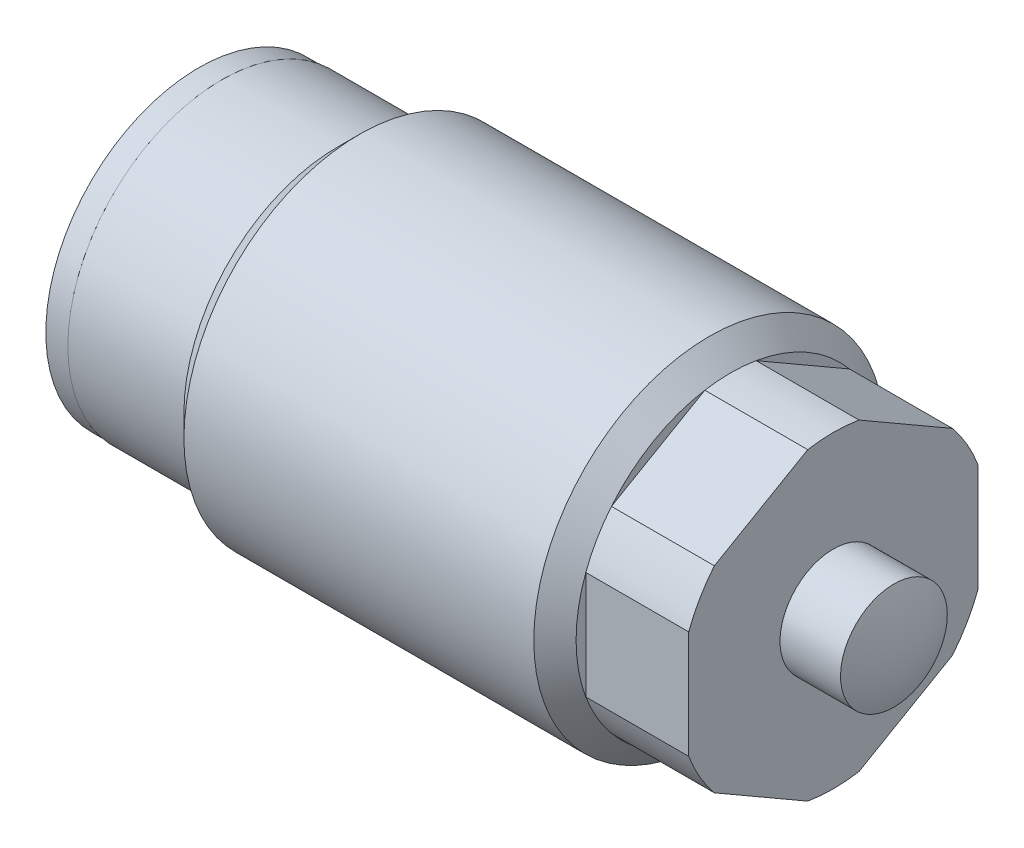
ISO-10303-21;
HEADER;
FILE_DESCRIPTION(('STEP AP214'),'2;1');
FILE_NAME('part.step','',(''),(''),'','','');
FILE_SCHEMA(('AUTOMOTIVE_DESIGN { 1 0 10303 214 1 1 1 1 }'));
ENDSEC;
DATA;
#1=APPLICATION_CONTEXT('core data for automotive mechanical design processes');
#2=APPLICATION_PROTOCOL_DEFINITION('international standard','automotive_design',2000,#1);
#3=PRODUCT_CONTEXT('',#1,'mechanical');
#4=PRODUCT('Part','Part','',(#3));
#5=PRODUCT_RELATED_PRODUCT_CATEGORY('part','',(#4));
#6=PRODUCT_DEFINITION_FORMATION('','',#4);
#7=PRODUCT_DEFINITION_CONTEXT('part definition',#1,'design');
#8=PRODUCT_DEFINITION('design','',#6,#7);
#9=PRODUCT_DEFINITION_SHAPE('','',#8);
#10=(LENGTH_UNIT() NAMED_UNIT(*) SI_UNIT(.MILLI.,.METRE.));
#11=(NAMED_UNIT(*) PLANE_ANGLE_UNIT() SI_UNIT($,.RADIAN.));
#12=(NAMED_UNIT(*) SI_UNIT($,.STERADIAN.) SOLID_ANGLE_UNIT());
#13=UNCERTAINTY_MEASURE_WITH_UNIT(LENGTH_MEASURE(1.E-05),#10,'distance_accuracy_value','');
#14=(GEOMETRIC_REPRESENTATION_CONTEXT(3) GLOBAL_UNCERTAINTY_ASSIGNED_CONTEXT((#13)) GLOBAL_UNIT_ASSIGNED_CONTEXT((#10,
#11,#12)) REPRESENTATION_CONTEXT('',''));
#15=CARTESIAN_POINT('',(0.,0.,0.));
#16=DIRECTION('',(0.,0.,1.));
#17=DIRECTION('',(1.,0.,0.));
#18=AXIS2_PLACEMENT_3D('',#15,#16,#17);
#19=CARTESIAN_POINT('',(22.606,7.7978,0.));
#20=DIRECTION('',(1.,0.,0.));
#21=DIRECTION('',(0.,0.,-1.));
#22=AXIS2_PLACEMENT_3D('',#19,#20,#21);
#23=PLANE('',#22);
#24=DIRECTION('',(0.,-0.5,-0.866025403784439));
#25=VECTOR('',#24,1.);
#26=CARTESIAN_POINT('',(22.606,-3.71016829986637,6.4262));
#27=LINE('',#26,#25);
#28=CARTESIAN_POINT('',(22.606,-4.36774278804313,5.28724757671676));
#29=VERTEX_POINT('',#28);
#30=CARTESIAN_POINT('',(22.606,-6.76276211155599,1.13895242328324));
#31=VERTEX_POINT('',#30);
#32=EDGE_CURVE('E196',#29,#31,#27,.T.);
#33=ORIENTED_EDGE('',*,*,#32,.F.);
#34=CARTESIAN_POINT('',(22.606,0.,0.));
#35=DIRECTION('',(1.,0.,0.));
#36=DIRECTION('',(0.,0.,-1.));
#37=AXIS2_PLACEMENT_3D('',#34,#35,#36);
#38=CIRCLE('',#37,6.85799999999999);
#39=EDGE_CURVE('E12',#29,#31,#38,.T.);
#40=ORIENTED_EDGE('',*,*,#39,.T.);
#41=EDGE_LOOP('',(#33,#40));
#42=FACE_BOUND('',#41,.T.);
#43=ADVANCED_FACE('F41',(#42),#23,.T.);
#44=DIRECTION('',(0.,0.5,-0.866025403784439));
#45=VECTOR('',#44,1.);
#46=CARTESIAN_POINT('',(22.606,-7.42033659973275,0.));
#47=LINE('',#46,#45);
#48=CARTESIAN_POINT('',(22.606,-6.76276211155599,-1.13895242328325));
#49=VERTEX_POINT('',#48);
#50=CARTESIAN_POINT('',(22.606,-4.36774278804314,-5.28724757671675));
#51=VERTEX_POINT('',#50);
#52=EDGE_CURVE('E194',#49,#51,#47,.T.);
#53=ORIENTED_EDGE('',*,*,#52,.F.);
#54=CARTESIAN_POINT('',(22.606,0.,0.));
#55=DIRECTION('',(1.,0.,0.));
#56=DIRECTION('',(0.,0.,-1.));
#57=AXIS2_PLACEMENT_3D('',#54,#55,#56);
#58=CIRCLE('',#57,6.85799999999999);
#59=EDGE_CURVE('E49',#49,#51,#58,.T.);
#60=ORIENTED_EDGE('',*,*,#59,.T.);
#61=EDGE_LOOP('',(#53,#60));
#62=FACE_BOUND('',#61,.T.);
#63=ADVANCED_FACE('F271',(#62),#23,.T.);
#64=DIRECTION('',(0.,1.,0.));
#65=VECTOR('',#64,1.);
#66=CARTESIAN_POINT('',(22.606,-3.71016829986638,-6.4262));
#67=LINE('',#66,#65);
#68=CARTESIAN_POINT('',(22.606,-2.39501932351286,-6.4262));
#69=VERTEX_POINT('',#68);
#70=CARTESIAN_POINT('',(22.606,2.39501932351286,-6.4262));
#71=VERTEX_POINT('',#70);
#72=EDGE_CURVE('E150',#69,#71,#67,.T.);
#73=ORIENTED_EDGE('',*,*,#72,.F.);
#74=CARTESIAN_POINT('',(22.606,0.,0.));
#75=DIRECTION('',(1.,0.,0.));
#76=DIRECTION('',(0.,0.,-1.));
#77=AXIS2_PLACEMENT_3D('',#74,#75,#76);
#78=CIRCLE('',#77,6.85799999999999);
#79=EDGE_CURVE('E159',#69,#71,#78,.T.);
#80=ORIENTED_EDGE('',*,*,#79,.T.);
#81=EDGE_LOOP('',(#73,#80));
#82=FACE_BOUND('',#81,.T.);
#83=ADVANCED_FACE('F158',(#82),#23,.T.);
#84=DIRECTION('',(0.,0.5,0.866025403784438));
#85=VECTOR('',#84,1.);
#86=CARTESIAN_POINT('',(22.606,3.71016829986637,-6.4262));
#87=LINE('',#86,#85);
#88=CARTESIAN_POINT('',(22.606,4.36774278804313,-5.28724757671676));
#89=VERTEX_POINT('',#88);
#90=CARTESIAN_POINT('',(22.606,6.76276211155599,-1.13895242328325));
#91=VERTEX_POINT('',#90);
#92=EDGE_CURVE('E161',#89,#91,#87,.T.);
#93=ORIENTED_EDGE('',*,*,#92,.F.);
#94=CARTESIAN_POINT('',(22.606,0.,0.));
#95=DIRECTION('',(1.,0.,0.));
#96=DIRECTION('',(0.,0.,-1.));
#97=AXIS2_PLACEMENT_3D('',#94,#95,#96);
#98=CIRCLE('',#97,6.85799999999999);
#99=EDGE_CURVE('E166',#89,#91,#98,.T.);
#100=ORIENTED_EDGE('',*,*,#99,.T.);
#101=EDGE_LOOP('',(#93,#100));
#102=FACE_BOUND('',#101,.T.);
#103=ADVANCED_FACE('F278',(#102),#23,.T.);
#104=DIRECTION('',(0.,-0.5,0.866025403784439));
#105=VECTOR('',#104,1.);
#106=CARTESIAN_POINT('',(22.606,7.42033659973275,0.));
#107=LINE('',#106,#105);
#108=CARTESIAN_POINT('',(22.606,6.76276211155599,1.13895242328324));
#109=VERTEX_POINT('',#108);
#110=CARTESIAN_POINT('',(22.606,4.36774278804313,5.28724757671676));
#111=VERTEX_POINT('',#110);
#112=EDGE_CURVE('E202',#109,#111,#107,.T.);
#113=ORIENTED_EDGE('',*,*,#112,.F.);
#114=CARTESIAN_POINT('',(22.606,0.,0.));
#115=DIRECTION('',(1.,0.,0.));
#116=DIRECTION('',(0.,0.,-1.));
#117=AXIS2_PLACEMENT_3D('',#114,#115,#116);
#118=CIRCLE('',#117,6.85799999999999);
#119=EDGE_CURVE('E168',#109,#111,#118,.T.);
#120=ORIENTED_EDGE('',*,*,#119,.T.);
#121=EDGE_LOOP('',(#113,#120));
#122=FACE_BOUND('',#121,.T.);
#123=ADVANCED_FACE('F286',(#122),#23,.T.);
#124=CARTESIAN_POINT('',(27.178,-3.71016829986638,-6.4262));
#125=DIRECTION('',(0.,0.,1.));
#126=DIRECTION('',(1.,0.,0.));
#127=AXIS2_PLACEMENT_3D('',#124,#125,#126);
#128=PLANE('',#127);
#129=DIRECTION('',(1.,0.,0.));
#130=VECTOR('',#129,1.);
#131=CARTESIAN_POINT('',(0.550490966654157,-2.39501932351286,-6.4262));
#132=LINE('',#131,#130);
#133=CARTESIAN_POINT('',(27.178,-2.39501932351286,-6.4262));
#134=VERTEX_POINT('',#133);
#135=EDGE_CURVE('E133',#69,#134,#132,.T.);
#136=ORIENTED_EDGE('',*,*,#135,.F.);
#137=ORIENTED_EDGE('',*,*,#72,.T.);
#138=DIRECTION('',(1.,0.,0.));
#139=VECTOR('',#138,1.);
#140=CARTESIAN_POINT('',(0.550490966654157,2.39501932351286,-6.4262));
#141=LINE('',#140,#139);
#142=CARTESIAN_POINT('',(27.178,2.39501932351286,-6.4262));
#143=VERTEX_POINT('',#142);
#144=EDGE_CURVE('E155',#143,#71,#141,.F.);
#145=ORIENTED_EDGE('',*,*,#144,.F.);
#146=DIRECTION('',(0.,1.,0.));
#147=VECTOR('',#146,1.);
#148=CARTESIAN_POINT('',(27.178,-3.71016829986638,-6.4262));
#149=LINE('',#148,#147);
#150=EDGE_CURVE('E153',#134,#143,#149,.T.);
#151=ORIENTED_EDGE('',*,*,#150,.F.);
#152=EDGE_LOOP('',(#136,#137,#145,#151));
#153=FACE_BOUND('',#152,.T.);
#154=ADVANCED_FACE('F148',(#153),#128,.F.);
#155=CARTESIAN_POINT('',(27.178,3.71016829986637,-6.4262));
#156=DIRECTION('',(0.,-0.866025403784438,0.5));
#157=DIRECTION('',(0.,-0.5,-0.866025403784439));
#158=AXIS2_PLACEMENT_3D('',#155,#156,#157);
#159=PLANE('',#158);
#160=DIRECTION('',(1.,0.,0.));
#161=VECTOR('',#160,1.);
#162=CARTESIAN_POINT('',(0.550490966654157,4.36774278804313,-5.28724757671676));
#163=LINE('',#162,#161);
#164=CARTESIAN_POINT('',(27.178,4.36774278804313,-5.28724757671676));
#165=VERTEX_POINT('',#164);
#166=EDGE_CURVE('E230',#89,#165,#163,.T.);
#167=ORIENTED_EDGE('',*,*,#166,.F.);
#168=ORIENTED_EDGE('',*,*,#92,.T.);
#169=DIRECTION('',(1.,0.,0.));
#170=VECTOR('',#169,1.);
#171=CARTESIAN_POINT('',(0.550490966654157,6.76276211155599,-1.13895242328324));
#172=LINE('',#171,#170);
#173=CARTESIAN_POINT('',(27.178,6.76276211155599,-1.13895242328324));
#174=VERTEX_POINT('',#173);
#175=EDGE_CURVE('E232',#174,#91,#172,.F.);
#176=ORIENTED_EDGE('',*,*,#175,.F.);
#177=DIRECTION('',(0.,0.5,0.866025403784438));
#178=VECTOR('',#177,1.);
#179=CARTESIAN_POINT('',(27.178,3.71016829986637,-6.4262));
#180=LINE('',#179,#178);
#181=EDGE_CURVE('E218',#165,#174,#180,.T.);
#182=ORIENTED_EDGE('',*,*,#181,.F.);
#183=EDGE_LOOP('',(#167,#168,#176,#182));
#184=FACE_BOUND('',#183,.T.);
#185=ADVANCED_FACE('F316',(#184),#159,.F.);
#186=CARTESIAN_POINT('',(27.178,7.42033659973275,0.));
#187=DIRECTION('',(0.,-0.866025403784439,-0.5));
#188=DIRECTION('',(0.,0.5,-0.866025403784439));
#189=AXIS2_PLACEMENT_3D('',#186,#187,#188);
#190=PLANE('',#189);
#191=DIRECTION('',(1.,0.,0.));
#192=VECTOR('',#191,1.);
#193=CARTESIAN_POINT('',(0.550490966654157,6.76276211155599,1.13895242328324));
#194=LINE('',#193,#192);
#195=CARTESIAN_POINT('',(27.178,6.76276211155599,1.13895242328324));
#196=VERTEX_POINT('',#195);
#197=EDGE_CURVE('E235',#109,#196,#194,.T.);
#198=ORIENTED_EDGE('',*,*,#197,.F.);
#199=ORIENTED_EDGE('',*,*,#112,.T.);
#200=DIRECTION('',(1.,0.,0.));
#201=VECTOR('',#200,1.);
#202=CARTESIAN_POINT('',(0.550490966654157,4.36774278804313,5.28724757671675));
#203=LINE('',#202,#201);
#204=CARTESIAN_POINT('',(27.178,4.36774278804313,5.28724757671675));
#205=VERTEX_POINT('',#204);
#206=EDGE_CURVE('E237',#205,#111,#203,.F.);
#207=ORIENTED_EDGE('',*,*,#206,.F.);
#208=DIRECTION('',(0.,-0.5,0.866025403784439));
#209=VECTOR('',#208,1.);
#210=CARTESIAN_POINT('',(27.178,7.42033659973275,0.));
#211=LINE('',#210,#209);
#212=EDGE_CURVE('E215',#196,#205,#211,.T.);
#213=ORIENTED_EDGE('',*,*,#212,.F.);
#214=EDGE_LOOP('',(#198,#199,#207,#213));
#215=FACE_BOUND('',#214,.T.);
#216=ADVANCED_FACE('F319',(#215),#190,.F.);
#217=CARTESIAN_POINT('',(27.178,3.71016829986638,6.4262));
#218=DIRECTION('',(0.,0.,-1.));
#219=DIRECTION('',(0.,1.,0.));
#220=AXIS2_PLACEMENT_3D('',#217,#218,#219);
#221=PLANE('',#220);
#222=DIRECTION('',(1.,0.,0.));
#223=VECTOR('',#222,1.);
#224=CARTESIAN_POINT('',(0.550490966654157,2.39501932351287,6.4262));
#225=LINE('',#224,#223);
#226=CARTESIAN_POINT('',(22.606,2.39501932351287,6.4262));
#227=VERTEX_POINT('',#226);
#228=CARTESIAN_POINT('',(27.178,2.39501932351287,6.4262));
#229=VERTEX_POINT('',#228);
#230=EDGE_CURVE('E240',#227,#229,#225,.T.);
#231=ORIENTED_EDGE('',*,*,#230,.F.);
#232=DIRECTION('',(0.,-1.,0.));
#233=VECTOR('',#232,1.);
#234=CARTESIAN_POINT('',(22.606,3.71016829986638,6.4262));
#235=LINE('',#234,#233);
#236=CARTESIAN_POINT('',(22.606,-2.39501932351287,6.4262));
#237=VERTEX_POINT('',#236);
#238=EDGE_CURVE('E199',#227,#237,#235,.T.);
#239=ORIENTED_EDGE('',*,*,#238,.T.);
#240=DIRECTION('',(1.,0.,0.));
#241=VECTOR('',#240,1.);
#242=CARTESIAN_POINT('',(0.550490966654157,-2.39501932351287,6.4262));
#243=LINE('',#242,#241);
#244=CARTESIAN_POINT('',(27.178,-2.39501932351287,6.4262));
#245=VERTEX_POINT('',#244);
#246=EDGE_CURVE('E242',#245,#237,#243,.F.);
#247=ORIENTED_EDGE('',*,*,#246,.F.);
#248=DIRECTION('',(0.,-1.,0.));
#249=VECTOR('',#248,1.);
#250=CARTESIAN_POINT('',(27.178,3.71016829986638,6.4262));
#251=LINE('',#250,#249);
#252=EDGE_CURVE('E212',#229,#245,#251,.T.);
#253=ORIENTED_EDGE('',*,*,#252,.F.);
#254=EDGE_LOOP('',(#231,#239,#247,#253));
#255=FACE_BOUND('',#254,.T.);
#256=ADVANCED_FACE('F323',(#255),#221,.F.);
#257=CARTESIAN_POINT('',(27.178,-3.71016829986637,6.4262));
#258=DIRECTION('',(0.,0.866025403784439,-0.5));
#259=DIRECTION('',(0.,0.5,0.866025403784439));
#260=AXIS2_PLACEMENT_3D('',#257,#258,#259);
#261=PLANE('',#260);
#262=DIRECTION('',(1.,0.,0.));
#263=VECTOR('',#262,1.);
#264=CARTESIAN_POINT('',(0.550490966654157,-4.36774278804313,5.28724757671676));
#265=LINE('',#264,#263);
#266=CARTESIAN_POINT('',(27.178,-4.36774278804313,5.28724757671676));
#267=VERTEX_POINT('',#266);
#268=EDGE_CURVE('E64',#29,#267,#265,.T.);
#269=ORIENTED_EDGE('',*,*,#268,.F.);
#270=ORIENTED_EDGE('',*,*,#32,.T.);
#271=DIRECTION('',(1.,0.,0.));
#272=VECTOR('',#271,1.);
#273=CARTESIAN_POINT('',(0.550490966654157,-6.76276211155599,1.13895242328324));
#274=LINE('',#273,#272);
#275=CARTESIAN_POINT('',(27.178,-6.76276211155599,1.13895242328324));
#276=VERTEX_POINT('',#275);
#277=EDGE_CURVE('E246',#276,#31,#274,.F.);
#278=ORIENTED_EDGE('',*,*,#277,.F.);
#279=DIRECTION('',(0.,-0.5,-0.866025403784439));
#280=VECTOR('',#279,1.);
#281=CARTESIAN_POINT('',(27.178,-3.71016829986637,6.4262));
#282=LINE('',#281,#280);
#283=EDGE_CURVE('E209',#267,#276,#282,.T.);
#284=ORIENTED_EDGE('',*,*,#283,.F.);
#285=EDGE_LOOP('',(#269,#270,#278,#284));
#286=FACE_BOUND('',#285,.T.);
#287=ADVANCED_FACE('F327',(#286),#261,.F.);
#288=CARTESIAN_POINT('',(27.178,-7.42033659973275,0.));
#289=DIRECTION('',(0.,0.866025403784439,0.5));
#290=DIRECTION('',(0.,-0.5,0.866025403784439));
#291=AXIS2_PLACEMENT_3D('',#288,#289,#290);
#292=PLANE('',#291);
#293=DIRECTION('',(1.,0.,0.));
#294=VECTOR('',#293,1.);
#295=CARTESIAN_POINT('',(0.550490966654157,-6.76276211155599,-1.13895242328324));
#296=LINE('',#295,#294);
#297=CARTESIAN_POINT('',(27.178,-6.76276211155599,-1.13895242328324));
#298=VERTEX_POINT('',#297);
#299=EDGE_CURVE('E56',#49,#298,#296,.T.);
#300=ORIENTED_EDGE('',*,*,#299,.F.);
#301=ORIENTED_EDGE('',*,*,#52,.T.);
#302=DIRECTION('',(1.,0.,0.));
#303=VECTOR('',#302,1.);
#304=CARTESIAN_POINT('',(0.550490966654157,-4.36774278804313,-5.28724757671675));
#305=LINE('',#304,#303);
#306=CARTESIAN_POINT('',(27.178,-4.36774278804313,-5.28724757671676));
#307=VERTEX_POINT('',#306);
#308=EDGE_CURVE('E136',#307,#51,#305,.F.);
#309=ORIENTED_EDGE('',*,*,#308,.F.);
#310=DIRECTION('',(0.,0.5,-0.866025403784439));
#311=VECTOR('',#310,1.);
#312=CARTESIAN_POINT('',(27.178,-7.42033659973275,0.));
#313=LINE('',#312,#311);
#314=EDGE_CURVE('E193',#298,#307,#313,.T.);
#315=ORIENTED_EDGE('',*,*,#314,.F.);
#316=EDGE_LOOP('',(#300,#301,#309,#315));
#317=FACE_BOUND('',#316,.T.);
#318=ADVANCED_FACE('F269',(#317),#292,.F.);
#319=CARTESIAN_POINT('',(27.178,11.1305048995991,-6.4262));
#320=DIRECTION('',(1.,0.,0.));
#321=DIRECTION('',(0.,0.,-1.));
#322=AXIS2_PLACEMENT_3D('',#319,#320,#321);
#323=PLANE('',#322);
#324=CARTESIAN_POINT('',(27.178,0.,0.));
#325=DIRECTION('',(1.,0.,0.));
#326=DIRECTION('',(0.,0.,-1.));
#327=AXIS2_PLACEMENT_3D('',#324,#325,#326);
#328=CIRCLE('',#327,2.37109);
#329=CARTESIAN_POINT('',(27.178,0.,-2.37109));
#330=VERTEX_POINT('',#329);
#331=EDGE_CURVE('E181',#330,#330,#328,.T.);
#332=ORIENTED_EDGE('',*,*,#331,.F.);
#333=EDGE_LOOP('',(#332));
#334=FACE_BOUND('',#333,.T.);
#335=ORIENTED_EDGE('',*,*,#150,.T.);
#336=CARTESIAN_POINT('',(27.178,0.,0.));
#337=DIRECTION('',(1.,0.,0.));
#338=DIRECTION('',(0.,0.,-1.));
#339=AXIS2_PLACEMENT_3D('',#336,#337,#338);
#340=CIRCLE('',#339,6.858);
#341=EDGE_CURVE('E251',#143,#165,#340,.T.);
#342=ORIENTED_EDGE('',*,*,#341,.T.);
#343=ORIENTED_EDGE('',*,*,#181,.T.);
#344=CARTESIAN_POINT('',(27.178,0.,0.));
#345=DIRECTION('',(1.,0.,0.));
#346=DIRECTION('',(0.,0.,-1.));
#347=AXIS2_PLACEMENT_3D('',#344,#345,#346);
#348=CIRCLE('',#347,6.858);
#349=EDGE_CURVE('E177',#174,#196,#348,.T.);
#350=ORIENTED_EDGE('',*,*,#349,.T.);
#351=ORIENTED_EDGE('',*,*,#212,.T.);
#352=EDGE_CURVE('E370',#205,#229,#348,.T.);
#353=ORIENTED_EDGE('',*,*,#352,.T.);
#354=ORIENTED_EDGE('',*,*,#252,.T.);
#355=EDGE_CURVE('E369',#245,#267,#348,.T.);
#356=ORIENTED_EDGE('',*,*,#355,.T.);
#357=ORIENTED_EDGE('',*,*,#283,.T.);
#358=EDGE_CURVE('E180',#276,#298,#348,.T.);
#359=ORIENTED_EDGE('',*,*,#358,.T.);
#360=ORIENTED_EDGE('',*,*,#314,.T.);
#361=EDGE_CURVE('E178',#307,#134,#348,.T.);
#362=ORIENTED_EDGE('',*,*,#361,.T.);
#363=EDGE_LOOP('',(#335,#342,#343,#350,#351,#353,#354,#356,#357,#359,#360,#362));
#364=FACE_BOUND('',#363,.T.);
#365=ADVANCED_FACE('F284',(#334,#364),#323,.T.);
#366=ORIENTED_EDGE('',*,*,#238,.F.);
#367=CARTESIAN_POINT('',(22.606,0.,0.));
#368=DIRECTION('',(1.,0.,0.));
#369=DIRECTION('',(0.,0.,-1.));
#370=AXIS2_PLACEMENT_3D('',#367,#368,#369);
#371=CIRCLE('',#370,6.85799999999999);
#372=EDGE_CURVE('E172',#227,#237,#371,.T.);
#373=ORIENTED_EDGE('',*,*,#372,.T.);
#374=EDGE_LOOP('',(#366,#373));
#375=FACE_BOUND('',#374,.T.);
#376=ADVANCED_FACE('F280',(#375),#23,.T.);
#377=CARTESIAN_POINT('',(30.6025425410263,0.,0.));
#378=DIRECTION('',(-1.,0.,0.));
#379=DIRECTION('',(0.,0.,1.));
#380=AXIS2_PLACEMENT_3D('',#377,#378,#379);
#381=CYLINDRICAL_SURFACE('',#380,7.7978);
#382=CARTESIAN_POINT('',(21.6662,0.,0.));
#383=DIRECTION('',(1.,0.,0.));
#384=DIRECTION('',(0.,0.,-1.));
#385=AXIS2_PLACEMENT_3D('',#382,#383,#384);
#386=CIRCLE('',#385,7.7978);
#387=CARTESIAN_POINT('',(21.6662,0.,-7.7978));
#388=VERTEX_POINT('',#387);
#389=EDGE_CURVE('E174',#388,#388,#386,.F.);
#390=ORIENTED_EDGE('',*,*,#389,.T.);
#391=EDGE_LOOP('',(#390));
#392=FACE_BOUND('',#391,.T.);
#393=CARTESIAN_POINT('',(6.12139999999999,0.,0.));
#394=DIRECTION('',(-1.,0.,0.));
#395=DIRECTION('',(0.,0.,1.));
#396=AXIS2_PLACEMENT_3D('',#393,#394,#395);
#397=CIRCLE('',#396,7.7978);
#398=CARTESIAN_POINT('',(6.12139999999999,0.,7.7978));
#399=VERTEX_POINT('',#398);
#400=EDGE_CURVE('E190',#399,#399,#397,.T.);
#401=ORIENTED_EDGE('',*,*,#400,.F.);
#402=EDGE_LOOP('',(#401));
#403=FACE_BOUND('',#402,.T.);
#404=ADVANCED_FACE('F283',(#392,#403),#381,.T.);
#405=CARTESIAN_POINT('',(0.,0.,0.));
#406=DIRECTION('',(-1.,0.,0.));
#407=DIRECTION('',(0.,0.,1.));
#408=AXIS2_PLACEMENT_3D('',#405,#406,#407);
#409=PLANE('',#408);
#410=CARTESIAN_POINT('',(0.,0.,0.));
#411=DIRECTION('',(-1.,0.,0.));
#412=DIRECTION('',(0.,0.,1.));
#413=AXIS2_PLACEMENT_3D('',#410,#411,#412);
#414=CIRCLE('',#413,2.78130000000001);
#415=CARTESIAN_POINT('',(0.,0.,2.78130000000001));
#416=VERTEX_POINT('',#415);
#417=EDGE_CURVE('E154',#416,#416,#414,.T.);
#418=ORIENTED_EDGE('',*,*,#417,.F.);
#419=EDGE_LOOP('',(#418));
#420=FACE_BOUND('',#419,.T.);
#421=CARTESIAN_POINT('',(0.,0.,0.));
#422=DIRECTION('',(-1.,0.,0.));
#423=DIRECTION('',(0.,0.,1.));
#424=AXIS2_PLACEMENT_3D('',#421,#422,#423);
#425=CIRCLE('',#424,6.8326);
#426=CARTESIAN_POINT('',(0.,0.,6.8326));
#427=VERTEX_POINT('',#426);
#428=EDGE_CURVE('E184',#427,#427,#425,.T.);
#429=ORIENTED_EDGE('',*,*,#428,.T.);
#430=EDGE_LOOP('',(#429));
#431=FACE_BOUND('',#430,.T.);
#432=ADVANCED_FACE('F287',(#420,#431),#409,.T.);
#433=CARTESIAN_POINT('',(30.6025425410263,0.,0.));
#434=DIRECTION('',(-1.,0.,0.));
#435=DIRECTION('',(0.,0.,1.));
#436=AXIS2_PLACEMENT_3D('',#433,#434,#435);
#437=CYLINDRICAL_SURFACE('',#436,6.8326);
#438=CARTESIAN_POINT('',(5.1562,0.,0.));
#439=DIRECTION('',(-1.,0.,0.));
#440=DIRECTION('',(0.,0.,1.));
#441=AXIS2_PLACEMENT_3D('',#438,#439,#440);
#442=CIRCLE('',#441,6.8326);
#443=CARTESIAN_POINT('',(5.1562,0.,6.8326));
#444=VERTEX_POINT('',#443);
#445=EDGE_CURVE('E187',#444,#444,#442,.T.);
#446=ORIENTED_EDGE('',*,*,#445,.T.);
#447=EDGE_LOOP('',(#446));
#448=FACE_BOUND('',#447,.T.);
#449=ORIENTED_EDGE('',*,*,#428,.F.);
#450=EDGE_LOOP('',(#449));
#451=FACE_BOUND('',#450,.T.);
#452=ADVANCED_FACE('F294',(#448,#451),#437,.T.);
#453=CARTESIAN_POINT('',(5.1562,0.,0.));
#454=DIRECTION('',(1.,0.,0.));
#455=DIRECTION('',(0.,0.,-1.));
#456=AXIS2_PLACEMENT_3D('',#453,#454,#455);
#457=CONICAL_SURFACE('',#456,6.8326,0.785398163397452);
#458=ORIENTED_EDGE('',*,*,#400,.T.);
#459=EDGE_LOOP('',(#458));
#460=FACE_BOUND('',#459,.T.);
#461=ORIENTED_EDGE('',*,*,#445,.F.);
#462=EDGE_LOOP('',(#461));
#463=FACE_BOUND('',#462,.T.);
#464=ADVANCED_FACE('F300',(#460,#463),#457,.T.);
#465=CARTESIAN_POINT('',(27.178,0.,0.));
#466=DIRECTION('',(1.,0.,0.));
#467=DIRECTION('',(0.,0.,-1.));
#468=AXIS2_PLACEMENT_3D('',#465,#466,#467);
#469=CYLINDRICAL_SURFACE('',#468,2.37109);
#470=ORIENTED_EDGE('',*,*,#331,.T.);
#471=EDGE_LOOP('',(#470));
#472=FACE_BOUND('',#471,.T.);
#473=CARTESIAN_POINT('',(29.8683072760323,0.,0.));
#474=DIRECTION('',(1.,0.,0.));
#475=DIRECTION('',(0.,0.,-1.));
#476=AXIS2_PLACEMENT_3D('',#473,#474,#475);
#477=CIRCLE('',#476,2.37109);
#478=CARTESIAN_POINT('',(29.8683072760323,0.,-2.37109));
#479=VERTEX_POINT('',#478);
#480=EDGE_CURVE('E162',#479,#479,#477,.T.);
#481=ORIENTED_EDGE('',*,*,#480,.F.);
#482=EDGE_LOOP('',(#481));
#483=FACE_BOUND('',#482,.T.);
#484=ADVANCED_FACE('F303',(#472,#483),#469,.T.);
#485=CARTESIAN_POINT('',(23.9776,0.,0.));
#486=DIRECTION('',(1.,0.,0.));
#487=DIRECTION('',(0.,-1.,0.));
#488=AXIS2_PLACEMENT_3D('',#485,#486,#487);
#489=SPHERICAL_SURFACE('',#488,6.35);
#490=ORIENTED_EDGE('',*,*,#480,.T.);
#491=EDGE_LOOP('',(#490));
#492=FACE_BOUND('',#491,.T.);
#493=ADVANCED_FACE('F339',(#492),#489,.T.);
#494=CARTESIAN_POINT('',(1.143,0.,0.));
#495=DIRECTION('',(1.,0.,0.));
#496=DIRECTION('',(0.,0.,-1.));
#497=AXIS2_PLACEMENT_3D('',#494,#495,#496);
#498=PLANE('',#497);
#499=CARTESIAN_POINT('',(1.143,0.,0.));
#500=DIRECTION('',(-1.,0.,0.));
#501=DIRECTION('',(0.,0.,1.));
#502=AXIS2_PLACEMENT_3D('',#499,#500,#501);
#503=CIRCLE('',#502,2.78130000000001);
#504=CARTESIAN_POINT('',(1.143,0.,2.78130000000001));
#505=VERTEX_POINT('',#504);
#506=EDGE_CURVE('E224',#505,#505,#503,.T.);
#507=ORIENTED_EDGE('',*,*,#506,.T.);
#508=EDGE_LOOP('',(#507));
#509=FACE_BOUND('',#508,.T.);
#510=ADVANCED_FACE('F343',(#509),#498,.F.);
#511=CARTESIAN_POINT('',(0.,0.,0.));
#512=DIRECTION('',(-1.,0.,0.));
#513=DIRECTION('',(0.,0.,1.));
#514=AXIS2_PLACEMENT_3D('',#511,#512,#513);
#515=CYLINDRICAL_SURFACE('',#514,2.78130000000001);
#516=ORIENTED_EDGE('',*,*,#506,.F.);
#517=EDGE_LOOP('',(#516));
#518=FACE_BOUND('',#517,.T.);
#519=ORIENTED_EDGE('',*,*,#417,.T.);
#520=EDGE_LOOP('',(#519));
#521=FACE_BOUND('',#520,.T.);
#522=ADVANCED_FACE('F347',(#518,#521),#515,.F.);
#523=CARTESIAN_POINT('',(0.550490966654157,0.,0.));
#524=DIRECTION('',(1.,0.,0.));
#525=DIRECTION('',(0.,0.,-1.));
#526=AXIS2_PLACEMENT_3D('',#523,#524,#525);
#527=CYLINDRICAL_SURFACE('',#526,6.858);
#528=ORIENTED_EDGE('',*,*,#135,.T.);
#529=ORIENTED_EDGE('',*,*,#361,.F.);
#530=ORIENTED_EDGE('',*,*,#308,.T.);
#531=CARTESIAN_POINT('',(22.606,0.,0.));
#532=DIRECTION('',(1.,0.,0.));
#533=DIRECTION('',(0.,0.,-1.));
#534=AXIS2_PLACEMENT_3D('',#531,#532,#533);
#535=CIRCLE('',#534,6.858);
#536=EDGE_CURVE('E130',#69,#51,#535,.F.);
#537=ORIENTED_EDGE('',*,*,#536,.F.);
#538=EDGE_LOOP('',(#528,#529,#530,#537));
#539=FACE_BOUND('',#538,.T.);
#540=ADVANCED_FACE('F132',(#539),#527,.T.);
#541=ORIENTED_EDGE('',*,*,#277,.T.);
#542=EDGE_CURVE('E141',#49,#31,#535,.F.);
#543=ORIENTED_EDGE('',*,*,#542,.F.);
#544=ORIENTED_EDGE('',*,*,#299,.T.);
#545=ORIENTED_EDGE('',*,*,#358,.F.);
#546=EDGE_LOOP('',(#541,#543,#544,#545));
#547=FACE_BOUND('',#546,.T.);
#548=ADVANCED_FACE('F264',(#547),#527,.T.);
#549=ORIENTED_EDGE('',*,*,#246,.T.);
#550=EDGE_CURVE('E260',#29,#237,#535,.F.);
#551=ORIENTED_EDGE('',*,*,#550,.F.);
#552=ORIENTED_EDGE('',*,*,#268,.T.);
#553=ORIENTED_EDGE('',*,*,#355,.F.);
#554=EDGE_LOOP('',(#549,#551,#552,#553));
#555=FACE_BOUND('',#554,.T.);
#556=ADVANCED_FACE('F357',(#555),#527,.T.);
#557=ORIENTED_EDGE('',*,*,#206,.T.);
#558=EDGE_CURVE('E257',#227,#111,#535,.F.);
#559=ORIENTED_EDGE('',*,*,#558,.F.);
#560=ORIENTED_EDGE('',*,*,#230,.T.);
#561=ORIENTED_EDGE('',*,*,#352,.F.);
#562=EDGE_LOOP('',(#557,#559,#560,#561));
#563=FACE_BOUND('',#562,.T.);
#564=ADVANCED_FACE('F365',(#563),#527,.T.);
#565=ORIENTED_EDGE('',*,*,#175,.T.);
#566=EDGE_CURVE('E255',#109,#91,#535,.F.);
#567=ORIENTED_EDGE('',*,*,#566,.F.);
#568=ORIENTED_EDGE('',*,*,#197,.T.);
#569=ORIENTED_EDGE('',*,*,#349,.F.);
#570=EDGE_LOOP('',(#565,#567,#568,#569));
#571=FACE_BOUND('',#570,.T.);
#572=ADVANCED_FACE('F359',(#571),#527,.T.);
#573=ORIENTED_EDGE('',*,*,#144,.T.);
#574=EDGE_CURVE('E143',#89,#71,#535,.F.);
#575=ORIENTED_EDGE('',*,*,#574,.F.);
#576=ORIENTED_EDGE('',*,*,#166,.T.);
#577=ORIENTED_EDGE('',*,*,#341,.F.);
#578=EDGE_LOOP('',(#573,#575,#576,#577));
#579=FACE_BOUND('',#578,.T.);
#580=ADVANCED_FACE('F353',(#579),#527,.T.);
#581=CARTESIAN_POINT('',(21.6662,0.,0.));
#582=DIRECTION('',(-1.,0.,0.));
#583=DIRECTION('',(0.,0.,1.));
#584=AXIS2_PLACEMENT_3D('',#581,#582,#583);
#585=CONICAL_SURFACE('',#584,7.7978,0.785398163397453);
#586=ORIENTED_EDGE('',*,*,#39,.F.);
#587=ORIENTED_EDGE('',*,*,#550,.T.);
#588=ORIENTED_EDGE('',*,*,#372,.F.);
#589=ORIENTED_EDGE('',*,*,#558,.T.);
#590=ORIENTED_EDGE('',*,*,#119,.F.);
#591=ORIENTED_EDGE('',*,*,#566,.T.);
#592=ORIENTED_EDGE('',*,*,#99,.F.);
#593=ORIENTED_EDGE('',*,*,#574,.T.);
#594=ORIENTED_EDGE('',*,*,#79,.F.);
#595=ORIENTED_EDGE('',*,*,#536,.T.);
#596=ORIENTED_EDGE('',*,*,#59,.F.);
#597=ORIENTED_EDGE('',*,*,#542,.T.);
#598=EDGE_LOOP('',(#586,#587,#588,#589,#590,#591,#592,#593,#594,#595,#596,#597));
#599=FACE_BOUND('',#598,.T.);
#600=ORIENTED_EDGE('',*,*,#389,.F.);
#601=EDGE_LOOP('',(#600));
#602=FACE_BOUND('',#601,.T.);
#603=ADVANCED_FACE('F43',(#599,#602),#585,.T.);
#604=CLOSED_SHELL('',(#43,#63,#83,#103,#123,#154,#185,#216,#256,#287,#318,#365,#376,#404,#432,
#452,#464,#484,#493,#510,#522,#540,#548,#556,#564,#572,#580,#603));
#605=MANIFOLD_SOLID_BREP('B2',#604);
#606=CARTESIAN_POINT('',(-0.0254000000000024,4.9657,0.));
#607=DIRECTION('',(1.,0.,0.));
#608=DIRECTION('',(0.,0.,-1.));
#609=AXIS2_PLACEMENT_3D('',#606,#607,#608);
#610=PLANE('',#609);
#611=CARTESIAN_POINT('',(-0.0254000000000028,0.,0.));
#612=DIRECTION('',(1.,0.,0.));
#613=DIRECTION('',(0.,0.,-1.));
#614=AXIS2_PLACEMENT_3D('',#611,#612,#613);
#615=CIRCLE('',#614,6.7945);
#616=CARTESIAN_POINT('',(-0.0254000000000028,0.,-6.7945));
#617=VERTEX_POINT('',#616);
#618=EDGE_CURVE('E40',#617,#617,#615,.T.);
#619=ORIENTED_EDGE('',*,*,#618,.T.);
#620=EDGE_LOOP('',(#619));
#621=FACE_BOUND('',#620,.T.);
#622=CARTESIAN_POINT('',(-0.025400000000002,0.,0.));
#623=DIRECTION('',(1.,0.,0.));
#624=DIRECTION('',(0.,0.,-1.));
#625=AXIS2_PLACEMENT_3D('',#622,#623,#624);
#626=CIRCLE('',#625,4.9657);
#627=CARTESIAN_POINT('',(-0.025400000000002,0.,-4.9657));
#628=VERTEX_POINT('',#627);
#629=EDGE_CURVE('E590',#628,#628,#626,.T.);
#630=ORIENTED_EDGE('',*,*,#629,.F.);
#631=EDGE_LOOP('',(#630));
#632=FACE_BOUND('',#631,.T.);
#633=ADVANCED_FACE('F576',(#621,#632),#610,.T.);
#634=CARTESIAN_POINT('',(-0.762,0.,0.));
#635=DIRECTION('',(1.,0.,0.));
#636=DIRECTION('',(0.,0.,-1.));
#637=AXIS2_PLACEMENT_3D('',#634,#635,#636);
#638=CYLINDRICAL_SURFACE('',#637,6.7945);
#639=CARTESIAN_POINT('',(-1.016,0.,0.));
#640=DIRECTION('',(1.,0.,0.));
#641=DIRECTION('',(0.,0.,-1.));
#642=AXIS2_PLACEMENT_3D('',#639,#640,#641);
#643=CIRCLE('',#642,6.7945);
#644=CARTESIAN_POINT('',(-1.016,0.,-6.7945));
#645=VERTEX_POINT('',#644);
#646=EDGE_CURVE('E582',#645,#645,#643,.T.);
#647=ORIENTED_EDGE('',*,*,#646,.T.);
#648=EDGE_LOOP('',(#647));
#649=FACE_BOUND('',#648,.T.);
#650=ORIENTED_EDGE('',*,*,#618,.F.);
#651=EDGE_LOOP('',(#650));
#652=FACE_BOUND('',#651,.T.);
#653=ADVANCED_FACE('F600',(#649,#652),#638,.T.);
#654=CARTESIAN_POINT('',(-1.016,6.7945,0.));
#655=DIRECTION('',(-1.,0.,0.));
#656=DIRECTION('',(0.,0.,1.));
#657=AXIS2_PLACEMENT_3D('',#654,#655,#656);
#658=PLANE('',#657);
#659=CARTESIAN_POINT('',(-1.016,0.,0.));
#660=DIRECTION('',(1.,0.,0.));
#661=DIRECTION('',(0.,0.,-1.));
#662=AXIS2_PLACEMENT_3D('',#659,#660,#661);
#663=CIRCLE('',#662,4.9657);
#664=CARTESIAN_POINT('',(-1.016,0.,-4.9657));
#665=VERTEX_POINT('',#664);
#666=EDGE_CURVE('E586',#665,#665,#663,.T.);
#667=ORIENTED_EDGE('',*,*,#666,.T.);
#668=EDGE_LOOP('',(#667));
#669=FACE_BOUND('',#668,.T.);
#670=ORIENTED_EDGE('',*,*,#646,.F.);
#671=EDGE_LOOP('',(#670));
#672=FACE_BOUND('',#671,.T.);
#673=ADVANCED_FACE('F604',(#669,#672),#658,.T.);
#674=CARTESIAN_POINT('',(-0.762,0.,0.));
#675=DIRECTION('',(1.,0.,0.));
#676=DIRECTION('',(0.,0.,-1.));
#677=AXIS2_PLACEMENT_3D('',#674,#675,#676);
#678=CYLINDRICAL_SURFACE('',#677,4.9657);
#679=ORIENTED_EDGE('',*,*,#629,.T.);
#680=EDGE_LOOP('',(#679));
#681=FACE_BOUND('',#680,.T.);
#682=ORIENTED_EDGE('',*,*,#666,.F.);
#683=EDGE_LOOP('',(#682));
#684=FACE_BOUND('',#683,.T.);
#685=ADVANCED_FACE('F596',(#681,#684),#678,.F.);
#686=CLOSED_SHELL('',(#633,#653,#673,#685));
#687=MANIFOLD_SOLID_BREP('B6',#686);
#688=ADVANCED_BREP_SHAPE_REPRESENTATION('',(#18,#605,#687),#14);
#689=SHAPE_DEFINITION_REPRESENTATION(#9,#688);
ENDSEC;
END-ISO-10303-21;
